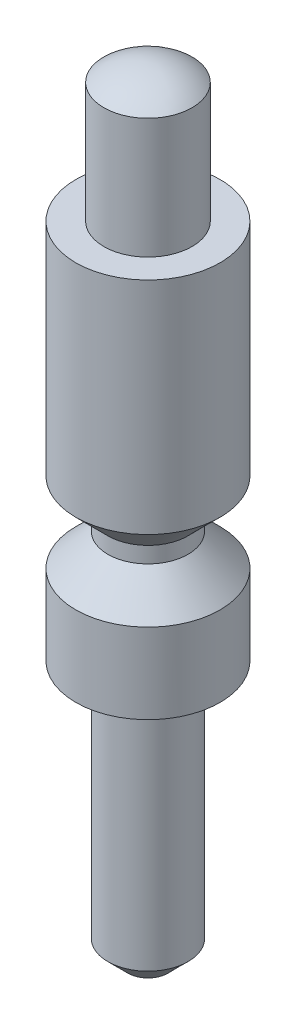
ISO-10303-21;
HEADER;
FILE_DESCRIPTION(('STEP AP214'),'2;1');
FILE_NAME('part.step','',(''),(''),'','','');
FILE_SCHEMA(('AUTOMOTIVE_DESIGN { 1 0 10303 214 1 1 1 1 }'));
ENDSEC;
DATA;
#1=APPLICATION_CONTEXT('core data for automotive mechanical design processes');
#2=APPLICATION_PROTOCOL_DEFINITION('international standard','automotive_design',2000,#1);
#3=PRODUCT_CONTEXT('',#1,'mechanical');
#4=PRODUCT('Part','Part','',(#3));
#5=PRODUCT_RELATED_PRODUCT_CATEGORY('part','',(#4));
#6=PRODUCT_DEFINITION_FORMATION('','',#4);
#7=PRODUCT_DEFINITION_CONTEXT('part definition',#1,'design');
#8=PRODUCT_DEFINITION('design','',#6,#7);
#9=PRODUCT_DEFINITION_SHAPE('','',#8);
#10=(LENGTH_UNIT() NAMED_UNIT(*) SI_UNIT(.MILLI.,.METRE.));
#11=(NAMED_UNIT(*) PLANE_ANGLE_UNIT() SI_UNIT($,.RADIAN.));
#12=(NAMED_UNIT(*) SI_UNIT($,.STERADIAN.) SOLID_ANGLE_UNIT());
#13=UNCERTAINTY_MEASURE_WITH_UNIT(LENGTH_MEASURE(1.E-05),#10,'distance_accuracy_value','');
#14=(GEOMETRIC_REPRESENTATION_CONTEXT(3) GLOBAL_UNCERTAINTY_ASSIGNED_CONTEXT((#13)) GLOBAL_UNIT_ASSIGNED_CONTEXT((#10,
#11,#12)) REPRESENTATION_CONTEXT('',''));
#15=CARTESIAN_POINT('',(0.,0.,0.));
#16=DIRECTION('',(0.,0.,1.));
#17=DIRECTION('',(1.,0.,0.));
#18=AXIS2_PLACEMENT_3D('',#15,#16,#17);
#19=CARTESIAN_POINT('',(33.072717540733,-5.552019390202,-3.434484021814));
#20=DIRECTION('',(0.,-1.,0.));
#21=DIRECTION('',(0.,0.,-1.));
#22=AXIS2_PLACEMENT_3D('',#19,#20,#21);
#23=PLANE('',#22);
#24=CARTESIAN_POINT('',(32.822717540733,-5.55201939027938,-3.434484021814));
#25=DIRECTION('',(0.,1.,0.));
#26=DIRECTION('',(0.,0.,1.));
#27=AXIS2_PLACEMENT_3D('',#24,#25,#26);
#28=CIRCLE('',#27,0.250000000012619);
#29=CARTESIAN_POINT('',(32.822717540733,-5.55201939027938,-3.18448402180138));
#30=VERTEX_POINT('',#29);
#31=EDGE_CURVE('E18',#30,#30,#28,.T.);
#32=ORIENTED_EDGE('',*,*,#31,.F.);
#33=EDGE_LOOP('',(#32));
#34=FACE_BOUND('',#33,.T.);
#35=ADVANCED_FACE('F15',(#34),#23,.T.);
#36=CARTESIAN_POINT('',(32.822717540733,-5.3020193902853,-3.434484021814));
#37=DIRECTION('',(0.,1.,0.));
#38=DIRECTION('',(0.,0.,1.));
#39=AXIS2_PLACEMENT_3D('',#36,#37,#38);
#40=CONICAL_SURFACE('',#39,0.500000000006707,0.785398163397448);
#41=ORIENTED_EDGE('',*,*,#31,.T.);
#42=EDGE_LOOP('',(#41));
#43=FACE_BOUND('',#42,.T.);
#44=CARTESIAN_POINT('',(32.822717540733,-5.302019390202,-3.434484021814));
#45=DIRECTION('',(0.,1.,0.));
#46=DIRECTION('',(0.,0.,1.));
#47=AXIS2_PLACEMENT_3D('',#44,#45,#46);
#48=CIRCLE('',#47,0.5);
#49=CARTESIAN_POINT('',(32.822717540733,-5.302019390202,-2.934484021814));
#50=VERTEX_POINT('',#49);
#51=EDGE_CURVE('E35',#50,#50,#48,.T.);
#52=ORIENTED_EDGE('',*,*,#51,.F.);
#53=EDGE_LOOP('',(#52));
#54=FACE_BOUND('',#53,.T.);
#55=ADVANCED_FACE('F55',(#43,#54),#40,.T.);
#56=CARTESIAN_POINT('',(32.822717540733,2.447980609798,-3.434484021814));
#57=DIRECTION('',(0.,1.,0.));
#58=DIRECTION('',(0.,0.,1.));
#59=AXIS2_PLACEMENT_3D('',#56,#57,#58);
#60=CYLINDRICAL_SURFACE('',#59,0.5);
#61=CARTESIAN_POINT('',(32.822717540733,-2.302019390202,-3.434484021814));
#62=DIRECTION('',(0.,1.,0.));
#63=DIRECTION('',(0.,0.,1.));
#64=AXIS2_PLACEMENT_3D('',#61,#62,#63);
#65=CIRCLE('',#64,0.5);
#66=CARTESIAN_POINT('',(32.822717540733,-2.302019390202,-2.934484021814));
#67=VERTEX_POINT('',#66);
#68=EDGE_CURVE('E106',#67,#67,#65,.T.);
#69=ORIENTED_EDGE('',*,*,#68,.F.);
#70=EDGE_LOOP('',(#69));
#71=FACE_BOUND('',#70,.T.);
#72=ORIENTED_EDGE('',*,*,#51,.T.);
#73=EDGE_LOOP('',(#72));
#74=FACE_BOUND('',#73,.T.);
#75=ADVANCED_FACE('F52',(#71,#74),#60,.T.);
#76=CARTESIAN_POINT('',(33.722717540733,-2.302019390202,-3.434484021814));
#77=DIRECTION('',(0.,-1.,0.));
#78=DIRECTION('',(0.,0.,-1.));
#79=AXIS2_PLACEMENT_3D('',#76,#77,#78);
#80=PLANE('',#79);
#81=ORIENTED_EDGE('',*,*,#68,.T.);
#82=EDGE_LOOP('',(#81));
#83=FACE_BOUND('',#82,.T.);
#84=CARTESIAN_POINT('',(32.822717540733,-2.302019390202,-3.434484021814));
#85=DIRECTION('',(0.,1.,0.));
#86=DIRECTION('',(0.,0.,1.));
#87=AXIS2_PLACEMENT_3D('',#84,#85,#86);
#88=CIRCLE('',#87,0.9);
#89=CARTESIAN_POINT('',(32.822717540733,-2.302019390202,-2.534484021814));
#90=VERTEX_POINT('',#89);
#91=EDGE_CURVE('E104',#90,#90,#88,.T.);
#92=ORIENTED_EDGE('',*,*,#91,.F.);
#93=EDGE_LOOP('',(#92));
#94=FACE_BOUND('',#93,.T.);
#95=ADVANCED_FACE('F48',(#83,#94),#80,.T.);
#96=CARTESIAN_POINT('',(32.822717540733,2.447980609798,-3.434484021814));
#97=DIRECTION('',(0.,1.,0.));
#98=DIRECTION('',(0.,0.,1.));
#99=AXIS2_PLACEMENT_3D('',#96,#97,#98);
#100=CYLINDRICAL_SURFACE('',#99,0.9);
#101=CARTESIAN_POINT('',(32.822717540733,-1.30201939020935,-3.434484021814));
#102=DIRECTION('',(0.,-1.,0.));
#103=DIRECTION('',(0.,0.,-1.));
#104=AXIS2_PLACEMENT_3D('',#101,#102,#103);
#105=CIRCLE('',#104,0.899999999982925);
#106=CARTESIAN_POINT('',(32.822717540733,-1.30201939020935,-4.33448402179692));
#107=VERTEX_POINT('',#106);
#108=EDGE_CURVE('E103',#107,#107,#105,.F.);
#109=ORIENTED_EDGE('',*,*,#108,.F.);
#110=EDGE_LOOP('',(#109));
#111=FACE_BOUND('',#110,.T.);
#112=ORIENTED_EDGE('',*,*,#91,.T.);
#113=EDGE_LOOP('',(#112));
#114=FACE_BOUND('',#113,.T.);
#115=ADVANCED_FACE('F43',(#111,#114),#100,.T.);
#116=CARTESIAN_POINT('',(32.822717540733,3.291730609798,-3.434484021814));
#117=DIRECTION('',(1.,0.,0.));
#118=DIRECTION('',(0.,1.,0.));
#119=AXIS2_PLACEMENT_3D('',#116,#117,#118);
#120=SPHERICAL_SURFACE('',#119,0.85625);
#121=CARTESIAN_POINT('',(32.822717540733,3.947980609798,-3.434484021814));
#122=DIRECTION('',(0.,1.,0.));
#123=DIRECTION('',(0.,0.,1.));
#124=AXIS2_PLACEMENT_3D('',#121,#122,#123);
#125=CIRCLE('',#124,0.55);
#126=CARTESIAN_POINT('',(32.822717540733,3.947980609798,-2.884484021814));
#127=VERTEX_POINT('',#126);
#128=EDGE_CURVE('E94',#127,#127,#125,.F.);
#129=ORIENTED_EDGE('',*,*,#128,.F.);
#130=EDGE_LOOP('',(#129));
#131=FACE_BOUND('',#130,.T.);
#132=ADVANCED_FACE('F38',(#131),#120,.T.);
#133=CARTESIAN_POINT('',(32.822717540733,-1.30201939009567,-3.434484021814));
#134=DIRECTION('',(0.,-1.,0.));
#135=DIRECTION('',(0.,0.,-1.));
#136=AXIS2_PLACEMENT_3D('',#133,#134,#135);
#137=CONICAL_SURFACE('',#136,0.899999999926081,0.785398163468503);
#138=CARTESIAN_POINT('',(32.822717540733,-0.902019390202,-3.434484021814));
#139=DIRECTION('',(0.,1.,0.));
#140=DIRECTION('',(0.,0.,1.));
#141=AXIS2_PLACEMENT_3D('',#138,#139,#140);
#142=CIRCLE('',#141,0.5);
#143=CARTESIAN_POINT('',(32.822717540733,-0.902019390202,-2.934484021814));
#144=VERTEX_POINT('',#143);
#145=EDGE_CURVE('E97',#144,#144,#142,.T.);
#146=ORIENTED_EDGE('',*,*,#145,.F.);
#147=EDGE_LOOP('',(#146));
#148=FACE_BOUND('',#147,.T.);
#149=ORIENTED_EDGE('',*,*,#108,.T.);
#150=EDGE_LOOP('',(#149));
#151=FACE_BOUND('',#150,.T.);
#152=ADVANCED_FACE('F42',(#148,#151),#137,.T.);
#153=CARTESIAN_POINT('',(32.822717540733,2.447980609798,-3.434484021814));
#154=DIRECTION('',(0.,1.,0.));
#155=DIRECTION('',(0.,0.,1.));
#156=AXIS2_PLACEMENT_3D('',#153,#154,#155);
#157=CYLINDRICAL_SURFACE('',#156,0.55);
#158=ORIENTED_EDGE('',*,*,#128,.T.);
#159=EDGE_LOOP('',(#158));
#160=FACE_BOUND('',#159,.T.);
#161=CARTESIAN_POINT('',(32.822717540733,2.447980609798,-3.434484021814));
#162=DIRECTION('',(0.,1.,0.));
#163=DIRECTION('',(0.,0.,1.));
#164=AXIS2_PLACEMENT_3D('',#161,#162,#163);
#165=CIRCLE('',#164,0.55);
#166=CARTESIAN_POINT('',(32.822717540733,2.447980609798,-2.884484021814));
#167=VERTEX_POINT('',#166);
#168=EDGE_CURVE('E32',#167,#167,#165,.F.);
#169=ORIENTED_EDGE('',*,*,#168,.F.);
#170=EDGE_LOOP('',(#169));
#171=FACE_BOUND('',#170,.T.);
#172=ADVANCED_FACE('F83',(#160,#171),#157,.T.);
#173=CARTESIAN_POINT('',(32.822717540733,2.447980609798,-3.434484021814));
#174=DIRECTION('',(0.,1.,0.));
#175=DIRECTION('',(0.,0.,1.));
#176=AXIS2_PLACEMENT_3D('',#173,#174,#175);
#177=CYLINDRICAL_SURFACE('',#176,0.5);
#178=ORIENTED_EDGE('',*,*,#145,.T.);
#179=EDGE_LOOP('',(#178));
#180=FACE_BOUND('',#179,.T.);
#181=CARTESIAN_POINT('',(32.822717540733,-0.702019390189434,-3.434484021814));
#182=DIRECTION('',(0.,1.,0.));
#183=DIRECTION('',(0.,0.,1.));
#184=AXIS2_PLACEMENT_3D('',#181,#182,#183);
#185=CIRCLE('',#184,0.500000000006707);
#186=CARTESIAN_POINT('',(32.822717540733,-0.702019390189434,-2.93448402180729));
#187=VERTEX_POINT('',#186);
#188=EDGE_CURVE('E27',#187,#187,#185,.T.);
#189=ORIENTED_EDGE('',*,*,#188,.F.);
#190=EDGE_LOOP('',(#189));
#191=FACE_BOUND('',#190,.T.);
#192=ADVANCED_FACE('F80',(#180,#191),#177,.T.);
#193=CARTESIAN_POINT('',(33.372717540733,2.447980609798,-3.434484021814));
#194=DIRECTION('',(0.,1.,0.));
#195=DIRECTION('',(0.,0.,1.));
#196=AXIS2_PLACEMENT_3D('',#193,#194,#195);
#197=PLANE('',#196);
#198=ORIENTED_EDGE('',*,*,#168,.T.);
#199=EDGE_LOOP('',(#198));
#200=FACE_BOUND('',#199,.T.);
#201=CARTESIAN_POINT('',(32.822717540733,2.447980609798,-3.434484021814));
#202=DIRECTION('',(0.,1.,0.));
#203=DIRECTION('',(0.,0.,1.));
#204=AXIS2_PLACEMENT_3D('',#201,#202,#203);
#205=CIRCLE('',#204,0.9);
#206=CARTESIAN_POINT('',(32.822717540733,2.447980609798,-2.534484021814));
#207=VERTEX_POINT('',#206);
#208=EDGE_CURVE('E22',#207,#207,#205,.F.);
#209=ORIENTED_EDGE('',*,*,#208,.F.);
#210=EDGE_LOOP('',(#209));
#211=FACE_BOUND('',#210,.T.);
#212=ADVANCED_FACE('F73',(#200,#211),#197,.T.);
#213=CARTESIAN_POINT('',(32.822717540733,-0.302019390289843,-3.434484021814));
#214=DIRECTION('',(0.,1.,0.));
#215=DIRECTION('',(0.,0.,1.));
#216=AXIS2_PLACEMENT_3D('',#213,#214,#215);
#217=CONICAL_SURFACE('',#216,0.899999999906299,0.785398163397448);
#218=CARTESIAN_POINT('',(32.822717540733,-0.302019390202,-3.434484021814));
#219=DIRECTION('',(0.,1.,0.));
#220=DIRECTION('',(0.,0.,1.));
#221=AXIS2_PLACEMENT_3D('',#218,#219,#220);
#222=CIRCLE('',#221,0.9);
#223=CARTESIAN_POINT('',(32.822717540733,-0.302019390202,-2.534484021814));
#224=VERTEX_POINT('',#223);
#225=EDGE_CURVE('E10',#224,#224,#222,.T.);
#226=ORIENTED_EDGE('',*,*,#225,.F.);
#227=EDGE_LOOP('',(#226));
#228=FACE_BOUND('',#227,.T.);
#229=ORIENTED_EDGE('',*,*,#188,.T.);
#230=EDGE_LOOP('',(#229));
#231=FACE_BOUND('',#230,.T.);
#232=ADVANCED_FACE('F68',(#228,#231),#217,.T.);
#233=CARTESIAN_POINT('',(32.822717540733,2.447980609798,-3.434484021814));
#234=DIRECTION('',(0.,1.,0.));
#235=DIRECTION('',(0.,0.,1.));
#236=AXIS2_PLACEMENT_3D('',#233,#234,#235);
#237=CYLINDRICAL_SURFACE('',#236,0.9);
#238=ORIENTED_EDGE('',*,*,#225,.T.);
#239=EDGE_LOOP('',(#238));
#240=FACE_BOUND('',#239,.T.);
#241=ORIENTED_EDGE('',*,*,#208,.T.);
#242=EDGE_LOOP('',(#241));
#243=FACE_BOUND('',#242,.T.);
#244=ADVANCED_FACE('F66',(#240,#243),#237,.T.);
#245=CLOSED_SHELL('',(#35,#55,#75,#95,#115,#132,#152,#172,#192,#212,#232,#244));
#246=MANIFOLD_SOLID_BREP('B1',#245);
#247=ADVANCED_BREP_SHAPE_REPRESENTATION('',(#18,#246),#14);
#248=SHAPE_DEFINITION_REPRESENTATION(#9,#247);
ENDSEC;
END-ISO-10303-21;
